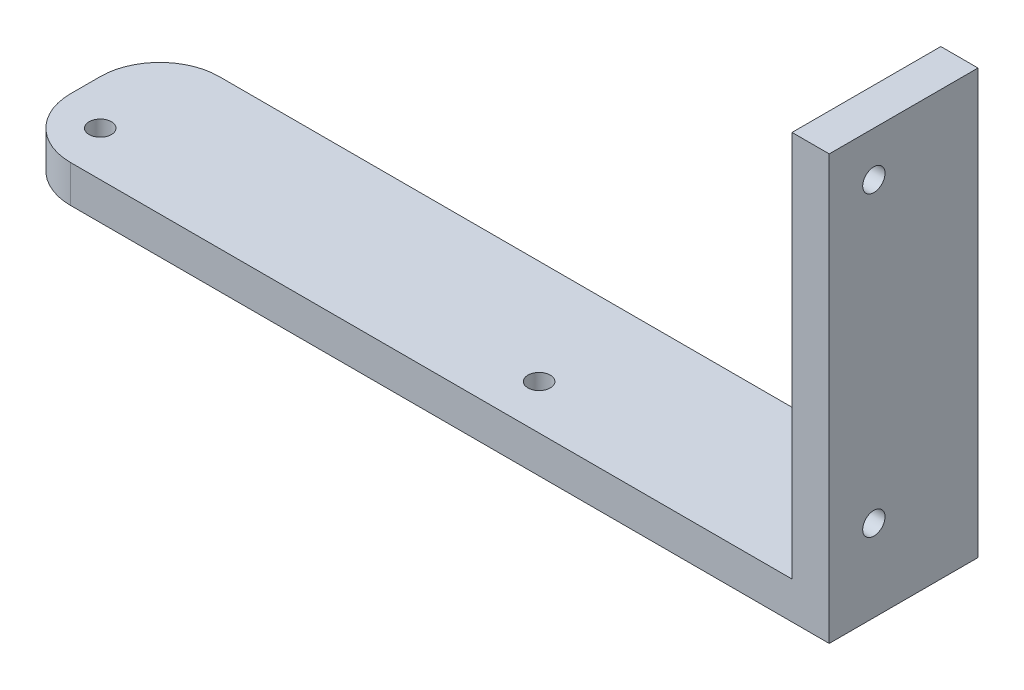
ISO-10303-21;
HEADER;
FILE_DESCRIPTION(('STEP AP214'),'2;1');
FILE_NAME('part.step','',(''),(''),'','','');
FILE_SCHEMA(('AUTOMOTIVE_DESIGN { 1 0 10303 214 1 1 1 1 }'));
ENDSEC;
DATA;
#1=APPLICATION_CONTEXT('core data for automotive mechanical design processes');
#2=APPLICATION_PROTOCOL_DEFINITION('international standard','automotive_design',2000,#1);
#3=PRODUCT_CONTEXT('',#1,'mechanical');
#4=PRODUCT('Part','Part','',(#3));
#5=PRODUCT_RELATED_PRODUCT_CATEGORY('part','',(#4));
#6=PRODUCT_DEFINITION_FORMATION('','',#4);
#7=PRODUCT_DEFINITION_CONTEXT('part definition',#1,'design');
#8=PRODUCT_DEFINITION('design','',#6,#7);
#9=PRODUCT_DEFINITION_SHAPE('','',#8);
#10=(LENGTH_UNIT() NAMED_UNIT(*) SI_UNIT(.MILLI.,.METRE.));
#11=(NAMED_UNIT(*) PLANE_ANGLE_UNIT() SI_UNIT($,.RADIAN.));
#12=(NAMED_UNIT(*) SI_UNIT($,.STERADIAN.) SOLID_ANGLE_UNIT());
#13=UNCERTAINTY_MEASURE_WITH_UNIT(LENGTH_MEASURE(1.E-05),#10,'distance_accuracy_value','');
#14=(GEOMETRIC_REPRESENTATION_CONTEXT(3) GLOBAL_UNCERTAINTY_ASSIGNED_CONTEXT((#13)) GLOBAL_UNIT_ASSIGNED_CONTEXT((#10,
#11,#12)) REPRESENTATION_CONTEXT('',''));
#15=CARTESIAN_POINT('',(0.,0.,0.));
#16=DIRECTION('',(0.,0.,1.));
#17=DIRECTION('',(1.,0.,0.));
#18=AXIS2_PLACEMENT_3D('',#15,#16,#17);
#19=CARTESIAN_POINT('',(0.,5.,0.));
#20=DIRECTION('',(0.,-1.,0.));
#21=DIRECTION('',(0.,0.,-1.));
#22=AXIS2_PLACEMENT_3D('',#19,#20,#21);
#23=PLANE('',#22);
#24=CARTESIAN_POINT('',(65.,5.,-6.));
#25=DIRECTION('',(0.,1.,0.));
#26=DIRECTION('',(0.,0.,1.));
#27=AXIS2_PLACEMENT_3D('',#24,#25,#26);
#28=CIRCLE('',#27,1.5);
#29=CARTESIAN_POINT('',(65.,5.,-4.5));
#30=VERTEX_POINT('',#29);
#31=EDGE_CURVE('E263',#30,#30,#28,.T.);
#32=ORIENTED_EDGE('',*,*,#31,.F.);
#33=EDGE_LOOP('',(#32));
#34=FACE_BOUND('',#33,.T.);
#35=CARTESIAN_POINT('',(6.,5.,-6.));
#36=DIRECTION('',(0.,1.,0.));
#37=DIRECTION('',(0.,0.,1.));
#38=AXIS2_PLACEMENT_3D('',#35,#36,#37);
#39=CIRCLE('',#38,1.5);
#40=CARTESIAN_POINT('',(6.,5.,-4.5));
#41=VERTEX_POINT('',#40);
#42=EDGE_CURVE('E134',#41,#41,#39,.T.);
#43=ORIENTED_EDGE('',*,*,#42,.F.);
#44=EDGE_LOOP('',(#43));
#45=FACE_BOUND('',#44,.T.);
#46=DIRECTION('',(-1.,0.,0.));
#47=VECTOR('',#46,1.);
#48=CARTESIAN_POINT('',(0.,5.,-20.));
#49=LINE('',#48,#47);
#50=CARTESIAN_POINT('',(105.,5.,-20.));
#51=VERTEX_POINT('',#50);
#52=CARTESIAN_POINT('',(8.,5.,-20.));
#53=VERTEX_POINT('',#52);
#54=EDGE_CURVE('E113',#51,#53,#49,.T.);
#55=ORIENTED_EDGE('',*,*,#54,.T.);
#56=CARTESIAN_POINT('',(8.,5.,-12.));
#57=DIRECTION('',(0.,-1.,0.));
#58=DIRECTION('',(0.,0.,-1.));
#59=AXIS2_PLACEMENT_3D('',#56,#57,#58);
#60=CIRCLE('',#59,8.);
#61=CARTESIAN_POINT('',(0.,5.,-12.));
#62=VERTEX_POINT('',#61);
#63=EDGE_CURVE('E43',#53,#62,#60,.F.);
#64=ORIENTED_EDGE('',*,*,#63,.T.);
#65=DIRECTION('',(0.,0.,1.));
#66=VECTOR('',#65,1.);
#67=CARTESIAN_POINT('',(0.,5.,0.));
#68=LINE('',#67,#66);
#69=CARTESIAN_POINT('',(0.,5.,-8.));
#70=VERTEX_POINT('',#69);
#71=EDGE_CURVE('E142',#62,#70,#68,.T.);
#72=ORIENTED_EDGE('',*,*,#71,.T.);
#73=CARTESIAN_POINT('',(8.,5.,-8.));
#74=DIRECTION('',(0.,-1.,0.));
#75=DIRECTION('',(0.,0.,-1.));
#76=AXIS2_PLACEMENT_3D('',#73,#74,#75);
#77=CIRCLE('',#76,8.);
#78=CARTESIAN_POINT('',(8.,5.,0.));
#79=VERTEX_POINT('',#78);
#80=EDGE_CURVE('E50',#70,#79,#77,.F.);
#81=ORIENTED_EDGE('',*,*,#80,.T.);
#82=DIRECTION('',(1.,0.,0.));
#83=VECTOR('',#82,1.);
#84=CARTESIAN_POINT('',(0.,5.,0.));
#85=LINE('',#84,#83);
#86=CARTESIAN_POINT('',(105.,5.,0.));
#87=VERTEX_POINT('',#86);
#88=EDGE_CURVE('E166',#79,#87,#85,.T.);
#89=ORIENTED_EDGE('',*,*,#88,.T.);
#90=DIRECTION('',(0.,0.,1.));
#91=VECTOR('',#90,1.);
#92=CARTESIAN_POINT('',(105.,5.,0.));
#93=LINE('',#92,#91);
#94=EDGE_CURVE('E128',#51,#87,#93,.T.);
#95=ORIENTED_EDGE('',*,*,#94,.F.);
#96=EDGE_LOOP('',(#55,#64,#72,#81,#89,#95));
#97=FACE_BOUND('',#96,.T.);
#98=ADVANCED_FACE('F35',(#34,#45,#97),#23,.F.);
#99=CARTESIAN_POINT('',(0.,5.,0.));
#100=DIRECTION('',(1.,0.,0.));
#101=DIRECTION('',(0.,0.,-1.));
#102=AXIS2_PLACEMENT_3D('',#99,#100,#101);
#103=PLANE('',#102);
#104=ORIENTED_EDGE('',*,*,#71,.F.);
#105=DIRECTION('',(0.,-1.,0.));
#106=VECTOR('',#105,1.);
#107=CARTESIAN_POINT('',(0.,5.,-12.));
#108=LINE('',#107,#106);
#109=CARTESIAN_POINT('',(0.,0.,-12.));
#110=VERTEX_POINT('',#109);
#111=EDGE_CURVE('E158',#62,#110,#108,.T.);
#112=ORIENTED_EDGE('',*,*,#111,.T.);
#113=DIRECTION('',(0.,0.,1.));
#114=VECTOR('',#113,1.);
#115=CARTESIAN_POINT('',(0.,0.,0.));
#116=LINE('',#115,#114);
#117=CARTESIAN_POINT('',(0.,0.,-8.));
#118=VERTEX_POINT('',#117);
#119=EDGE_CURVE('E153',#110,#118,#116,.T.);
#120=ORIENTED_EDGE('',*,*,#119,.T.);
#121=DIRECTION('',(0.,-1.,0.));
#122=VECTOR('',#121,1.);
#123=CARTESIAN_POINT('',(0.,5.,-8.));
#124=LINE('',#123,#122);
#125=EDGE_CURVE('E156',#118,#70,#124,.F.);
#126=ORIENTED_EDGE('',*,*,#125,.T.);
#127=EDGE_LOOP('',(#104,#112,#120,#126));
#128=FACE_BOUND('',#127,.T.);
#129=ADVANCED_FACE('F188',(#128),#103,.F.);
#130=CARTESIAN_POINT('',(0.,5.,0.));
#131=DIRECTION('',(0.,0.,-1.));
#132=DIRECTION('',(-1.,0.,0.));
#133=AXIS2_PLACEMENT_3D('',#130,#131,#132);
#134=PLANE('',#133);
#135=ORIENTED_EDGE('',*,*,#88,.F.);
#136=DIRECTION('',(0.,-1.,0.));
#137=VECTOR('',#136,1.);
#138=CARTESIAN_POINT('',(8.,5.,0.));
#139=LINE('',#138,#137);
#140=CARTESIAN_POINT('',(8.,0.,0.));
#141=VERTEX_POINT('',#140);
#142=EDGE_CURVE('E11',#79,#141,#139,.T.);
#143=ORIENTED_EDGE('',*,*,#142,.T.);
#144=DIRECTION('',(1.,0.,0.));
#145=VECTOR('',#144,1.);
#146=CARTESIAN_POINT('',(0.,0.,0.));
#147=LINE('',#146,#145);
#148=CARTESIAN_POINT('',(110.,0.,0.));
#149=VERTEX_POINT('',#148);
#150=EDGE_CURVE('E173',#141,#149,#147,.T.);
#151=ORIENTED_EDGE('',*,*,#150,.T.);
#152=DIRECTION('',(0.,-1.,0.));
#153=VECTOR('',#152,1.);
#154=CARTESIAN_POINT('',(110.,5.,0.));
#155=LINE('',#154,#153);
#156=CARTESIAN_POINT('',(110.,57.,0.));
#157=VERTEX_POINT('',#156);
#158=EDGE_CURVE('E112',#157,#149,#155,.T.);
#159=ORIENTED_EDGE('',*,*,#158,.F.);
#160=DIRECTION('',(1.,0.,0.));
#161=VECTOR('',#160,1.);
#162=CARTESIAN_POINT('',(110.,57.,0.));
#163=LINE('',#162,#161);
#164=CARTESIAN_POINT('',(105.,57.,0.));
#165=VERTEX_POINT('',#164);
#166=EDGE_CURVE('E127',#165,#157,#163,.T.);
#167=ORIENTED_EDGE('',*,*,#166,.F.);
#168=DIRECTION('',(0.,-1.,0.));
#169=VECTOR('',#168,1.);
#170=CARTESIAN_POINT('',(105.,57.,0.));
#171=LINE('',#170,#169);
#172=EDGE_CURVE('E139',#165,#87,#171,.T.);
#173=ORIENTED_EDGE('',*,*,#172,.T.);
#174=EDGE_LOOP('',(#135,#143,#151,#159,#167,#173));
#175=FACE_BOUND('',#174,.T.);
#176=ADVANCED_FACE('F192',(#175),#134,.F.);
#177=CARTESIAN_POINT('',(110.,5.,0.));
#178=DIRECTION('',(-1.,0.,0.));
#179=DIRECTION('',(0.,0.,1.));
#180=AXIS2_PLACEMENT_3D('',#177,#178,#179);
#181=PLANE('',#180);
#182=CARTESIAN_POINT('',(110.,51.,-6.));
#183=DIRECTION('',(-1.,0.,0.));
#184=DIRECTION('',(0.,0.,1.));
#185=AXIS2_PLACEMENT_3D('',#182,#183,#184);
#186=CIRCLE('',#185,1.5);
#187=CARTESIAN_POINT('',(110.,51.,-4.5));
#188=VERTEX_POINT('',#187);
#189=EDGE_CURVE('E253',#188,#188,#186,.T.);
#190=ORIENTED_EDGE('',*,*,#189,.T.);
#191=EDGE_LOOP('',(#190));
#192=FACE_BOUND('',#191,.T.);
#193=CARTESIAN_POINT('',(110.,11.,-6.));
#194=DIRECTION('',(-1.,0.,0.));
#195=DIRECTION('',(0.,0.,1.));
#196=AXIS2_PLACEMENT_3D('',#193,#194,#195);
#197=CIRCLE('',#196,1.5);
#198=CARTESIAN_POINT('',(110.,11.,-4.5));
#199=VERTEX_POINT('',#198);
#200=EDGE_CURVE('E260',#199,#199,#197,.T.);
#201=ORIENTED_EDGE('',*,*,#200,.T.);
#202=EDGE_LOOP('',(#201));
#203=FACE_BOUND('',#202,.T.);
#204=DIRECTION('',(0.,0.,-1.));
#205=VECTOR('',#204,1.);
#206=CARTESIAN_POINT('',(110.,0.,0.));
#207=LINE('',#206,#205);
#208=CARTESIAN_POINT('',(110.,0.,-20.));
#209=VERTEX_POINT('',#208);
#210=EDGE_CURVE('E110',#149,#209,#207,.T.);
#211=ORIENTED_EDGE('',*,*,#210,.T.);
#212=DIRECTION('',(0.,-1.,0.));
#213=VECTOR('',#212,1.);
#214=CARTESIAN_POINT('',(110.,5.,-20.));
#215=LINE('',#214,#213);
#216=CARTESIAN_POINT('',(110.,57.,-20.));
#217=VERTEX_POINT('',#216);
#218=EDGE_CURVE('E103',#217,#209,#215,.T.);
#219=ORIENTED_EDGE('',*,*,#218,.F.);
#220=DIRECTION('',(0.,0.,-1.));
#221=VECTOR('',#220,1.);
#222=CARTESIAN_POINT('',(110.,57.,0.));
#223=LINE('',#222,#221);
#224=EDGE_CURVE('E108',#157,#217,#223,.T.);
#225=ORIENTED_EDGE('',*,*,#224,.F.);
#226=ORIENTED_EDGE('',*,*,#158,.T.);
#227=EDGE_LOOP('',(#211,#219,#225,#226));
#228=FACE_BOUND('',#227,.T.);
#229=ADVANCED_FACE('F105',(#192,#203,#228),#181,.F.);
#230=CARTESIAN_POINT('',(0.,5.,-20.));
#231=DIRECTION('',(0.,0.,1.));
#232=DIRECTION('',(1.,0.,0.));
#233=AXIS2_PLACEMENT_3D('',#230,#231,#232);
#234=PLANE('',#233);
#235=DIRECTION('',(-1.,0.,0.));
#236=VECTOR('',#235,1.);
#237=CARTESIAN_POINT('',(0.,0.,-20.));
#238=LINE('',#237,#236);
#239=CARTESIAN_POINT('',(8.,0.,-20.));
#240=VERTEX_POINT('',#239);
#241=EDGE_CURVE('E176',#209,#240,#238,.T.);
#242=ORIENTED_EDGE('',*,*,#241,.T.);
#243=DIRECTION('',(0.,-1.,0.));
#244=VECTOR('',#243,1.);
#245=CARTESIAN_POINT('',(8.,5.,-20.));
#246=LINE('',#245,#244);
#247=EDGE_CURVE('E58',#240,#53,#246,.F.);
#248=ORIENTED_EDGE('',*,*,#247,.T.);
#249=ORIENTED_EDGE('',*,*,#54,.F.);
#250=DIRECTION('',(0.,-1.,0.));
#251=VECTOR('',#250,1.);
#252=CARTESIAN_POINT('',(105.,57.,-20.));
#253=LINE('',#252,#251);
#254=CARTESIAN_POINT('',(105.,57.,-20.));
#255=VERTEX_POINT('',#254);
#256=EDGE_CURVE('E119',#255,#51,#253,.T.);
#257=ORIENTED_EDGE('',*,*,#256,.F.);
#258=DIRECTION('',(-1.,0.,0.));
#259=VECTOR('',#258,1.);
#260=CARTESIAN_POINT('',(110.,57.,-20.));
#261=LINE('',#260,#259);
#262=EDGE_CURVE('E116',#217,#255,#261,.T.);
#263=ORIENTED_EDGE('',*,*,#262,.F.);
#264=ORIENTED_EDGE('',*,*,#218,.T.);
#265=EDGE_LOOP('',(#242,#248,#249,#257,#263,#264));
#266=FACE_BOUND('',#265,.T.);
#267=ADVANCED_FACE('F117',(#266),#234,.F.);
#268=CARTESIAN_POINT('',(0.,0.,0.));
#269=DIRECTION('',(0.,-1.,0.));
#270=DIRECTION('',(0.,0.,-1.));
#271=AXIS2_PLACEMENT_3D('',#268,#269,#270);
#272=PLANE('',#271);
#273=CARTESIAN_POINT('',(65.,0.,-6.));
#274=DIRECTION('',(0.,1.,0.));
#275=DIRECTION('',(0.,0.,1.));
#276=AXIS2_PLACEMENT_3D('',#273,#274,#275);
#277=CIRCLE('',#276,1.5);
#278=CARTESIAN_POINT('',(65.,0.,-4.5));
#279=VERTEX_POINT('',#278);
#280=EDGE_CURVE('E266',#279,#279,#277,.T.);
#281=ORIENTED_EDGE('',*,*,#280,.T.);
#282=EDGE_LOOP('',(#281));
#283=FACE_BOUND('',#282,.T.);
#284=CARTESIAN_POINT('',(6.,0.,-6.));
#285=DIRECTION('',(0.,1.,0.));
#286=DIRECTION('',(0.,0.,1.));
#287=AXIS2_PLACEMENT_3D('',#284,#285,#286);
#288=CIRCLE('',#287,1.5);
#289=CARTESIAN_POINT('',(6.,0.,-4.5));
#290=VERTEX_POINT('',#289);
#291=EDGE_CURVE('E131',#290,#290,#288,.T.);
#292=ORIENTED_EDGE('',*,*,#291,.T.);
#293=EDGE_LOOP('',(#292));
#294=FACE_BOUND('',#293,.T.);
#295=ORIENTED_EDGE('',*,*,#119,.F.);
#296=CARTESIAN_POINT('',(8.,0.,-12.));
#297=DIRECTION('',(0.,-1.,0.));
#298=DIRECTION('',(0.,0.,-1.));
#299=AXIS2_PLACEMENT_3D('',#296,#297,#298);
#300=CIRCLE('',#299,8.);
#301=EDGE_CURVE('E163',#110,#240,#300,.T.);
#302=ORIENTED_EDGE('',*,*,#301,.T.);
#303=ORIENTED_EDGE('',*,*,#241,.F.);
#304=ORIENTED_EDGE('',*,*,#210,.F.);
#305=ORIENTED_EDGE('',*,*,#150,.F.);
#306=CARTESIAN_POINT('',(8.,0.,-8.));
#307=DIRECTION('',(0.,-1.,0.));
#308=DIRECTION('',(0.,0.,-1.));
#309=AXIS2_PLACEMENT_3D('',#306,#307,#308);
#310=CIRCLE('',#309,8.);
#311=EDGE_CURVE('E161',#141,#118,#310,.T.);
#312=ORIENTED_EDGE('',*,*,#311,.T.);
#313=EDGE_LOOP('',(#295,#302,#303,#304,#305,#312));
#314=FACE_BOUND('',#313,.T.);
#315=ADVANCED_FACE('F181',(#283,#294,#314),#272,.T.);
#316=CARTESIAN_POINT('',(105.,57.,0.));
#317=DIRECTION('',(1.,0.,0.));
#318=DIRECTION('',(0.,0.,-1.));
#319=AXIS2_PLACEMENT_3D('',#316,#317,#318);
#320=PLANE('',#319);
#321=CARTESIAN_POINT('',(105.,51.,-6.));
#322=DIRECTION('',(-1.,0.,0.));
#323=DIRECTION('',(0.,0.,1.));
#324=AXIS2_PLACEMENT_3D('',#321,#322,#323);
#325=CIRCLE('',#324,1.5);
#326=CARTESIAN_POINT('',(105.,51.,-4.5));
#327=VERTEX_POINT('',#326);
#328=EDGE_CURVE('E255',#327,#327,#325,.T.);
#329=ORIENTED_EDGE('',*,*,#328,.F.);
#330=EDGE_LOOP('',(#329));
#331=FACE_BOUND('',#330,.T.);
#332=CARTESIAN_POINT('',(105.,11.,-6.));
#333=DIRECTION('',(-1.,0.,0.));
#334=DIRECTION('',(0.,0.,1.));
#335=AXIS2_PLACEMENT_3D('',#332,#333,#334);
#336=CIRCLE('',#335,1.5);
#337=CARTESIAN_POINT('',(105.,11.,-4.5));
#338=VERTEX_POINT('',#337);
#339=EDGE_CURVE('E257',#338,#338,#336,.T.);
#340=ORIENTED_EDGE('',*,*,#339,.F.);
#341=EDGE_LOOP('',(#340));
#342=FACE_BOUND('',#341,.T.);
#343=ORIENTED_EDGE('',*,*,#94,.T.);
#344=ORIENTED_EDGE('',*,*,#172,.F.);
#345=DIRECTION('',(0.,0.,1.));
#346=VECTOR('',#345,1.);
#347=CARTESIAN_POINT('',(105.,57.,0.));
#348=LINE('',#347,#346);
#349=EDGE_CURVE('E122',#255,#165,#348,.T.);
#350=ORIENTED_EDGE('',*,*,#349,.F.);
#351=ORIENTED_EDGE('',*,*,#256,.T.);
#352=EDGE_LOOP('',(#343,#344,#350,#351));
#353=FACE_BOUND('',#352,.T.);
#354=ADVANCED_FACE('F195',(#331,#342,#353),#320,.F.);
#355=CARTESIAN_POINT('',(0.,57.,0.));
#356=DIRECTION('',(0.,1.,0.));
#357=DIRECTION('',(0.,0.,1.));
#358=AXIS2_PLACEMENT_3D('',#355,#356,#357);
#359=PLANE('',#358);
#360=ORIENTED_EDGE('',*,*,#224,.T.);
#361=ORIENTED_EDGE('',*,*,#262,.T.);
#362=ORIENTED_EDGE('',*,*,#349,.T.);
#363=ORIENTED_EDGE('',*,*,#166,.T.);
#364=EDGE_LOOP('',(#360,#361,#362,#363));
#365=FACE_BOUND('',#364,.T.);
#366=ADVANCED_FACE('F125',(#365),#359,.T.);
#367=CARTESIAN_POINT('',(6.,0.,-6.));
#368=DIRECTION('',(0.,1.,0.));
#369=DIRECTION('',(0.,0.,1.));
#370=AXIS2_PLACEMENT_3D('',#367,#368,#369);
#371=CYLINDRICAL_SURFACE('',#370,1.5);
#372=ORIENTED_EDGE('',*,*,#291,.F.);
#373=EDGE_LOOP('',(#372));
#374=FACE_BOUND('',#373,.T.);
#375=ORIENTED_EDGE('',*,*,#42,.T.);
#376=EDGE_LOOP('',(#375));
#377=FACE_BOUND('',#376,.T.);
#378=ADVANCED_FACE('F203',(#374,#377),#371,.F.);
#379=CARTESIAN_POINT('',(65.,0.,-6.));
#380=DIRECTION('',(0.,1.,0.));
#381=DIRECTION('',(0.,0.,1.));
#382=AXIS2_PLACEMENT_3D('',#379,#380,#381);
#383=CYLINDRICAL_SURFACE('',#382,1.5);
#384=ORIENTED_EDGE('',*,*,#280,.F.);
#385=EDGE_LOOP('',(#384));
#386=FACE_BOUND('',#385,.T.);
#387=ORIENTED_EDGE('',*,*,#31,.T.);
#388=EDGE_LOOP('',(#387));
#389=FACE_BOUND('',#388,.T.);
#390=ADVANCED_FACE('F226',(#386,#389),#383,.F.);
#391=CARTESIAN_POINT('',(8.,5.,-12.));
#392=DIRECTION('',(0.,-1.,0.));
#393=DIRECTION('',(0.,0.,-1.));
#394=AXIS2_PLACEMENT_3D('',#391,#392,#393);
#395=CYLINDRICAL_SURFACE('',#394,8.);
#396=ORIENTED_EDGE('',*,*,#63,.F.);
#397=ORIENTED_EDGE('',*,*,#247,.F.);
#398=ORIENTED_EDGE('',*,*,#301,.F.);
#399=ORIENTED_EDGE('',*,*,#111,.F.);
#400=EDGE_LOOP('',(#396,#397,#398,#399));
#401=FACE_BOUND('',#400,.T.);
#402=ADVANCED_FACE('F184',(#401),#395,.T.);
#403=CARTESIAN_POINT('',(8.,5.,-8.));
#404=DIRECTION('',(0.,-1.,0.));
#405=DIRECTION('',(0.,0.,-1.));
#406=AXIS2_PLACEMENT_3D('',#403,#404,#405);
#407=CYLINDRICAL_SURFACE('',#406,8.);
#408=ORIENTED_EDGE('',*,*,#80,.F.);
#409=ORIENTED_EDGE('',*,*,#125,.F.);
#410=ORIENTED_EDGE('',*,*,#311,.F.);
#411=ORIENTED_EDGE('',*,*,#142,.F.);
#412=EDGE_LOOP('',(#408,#409,#410,#411));
#413=FACE_BOUND('',#412,.T.);
#414=ADVANCED_FACE('F37',(#413),#407,.T.);
#415=CARTESIAN_POINT('',(110.,11.,-6.));
#416=DIRECTION('',(-1.,0.,0.));
#417=DIRECTION('',(0.,0.,1.));
#418=AXIS2_PLACEMENT_3D('',#415,#416,#417);
#419=CYLINDRICAL_SURFACE('',#418,1.5);
#420=ORIENTED_EDGE('',*,*,#200,.F.);
#421=EDGE_LOOP('',(#420));
#422=FACE_BOUND('',#421,.T.);
#423=ORIENTED_EDGE('',*,*,#339,.T.);
#424=EDGE_LOOP('',(#423));
#425=FACE_BOUND('',#424,.T.);
#426=ADVANCED_FACE('F231',(#422,#425),#419,.F.);
#427=CARTESIAN_POINT('',(110.,51.,-6.));
#428=DIRECTION('',(-1.,0.,0.));
#429=DIRECTION('',(0.,0.,1.));
#430=AXIS2_PLACEMENT_3D('',#427,#428,#429);
#431=CYLINDRICAL_SURFACE('',#430,1.5);
#432=ORIENTED_EDGE('',*,*,#189,.F.);
#433=EDGE_LOOP('',(#432));
#434=FACE_BOUND('',#433,.T.);
#435=ORIENTED_EDGE('',*,*,#328,.T.);
#436=EDGE_LOOP('',(#435));
#437=FACE_BOUND('',#436,.T.);
#438=ADVANCED_FACE('F244',(#434,#437),#431,.F.);
#439=CLOSED_SHELL('',(#98,#129,#176,#229,#267,#315,#354,#366,#378,#390,#402,#414,#426,#438));
#440=MANIFOLD_SOLID_BREP('B2',#439);
#441=ADVANCED_BREP_SHAPE_REPRESENTATION('',(#18,#440),#14);
#442=SHAPE_DEFINITION_REPRESENTATION(#9,#441);
ENDSEC;
END-ISO-10303-21;
